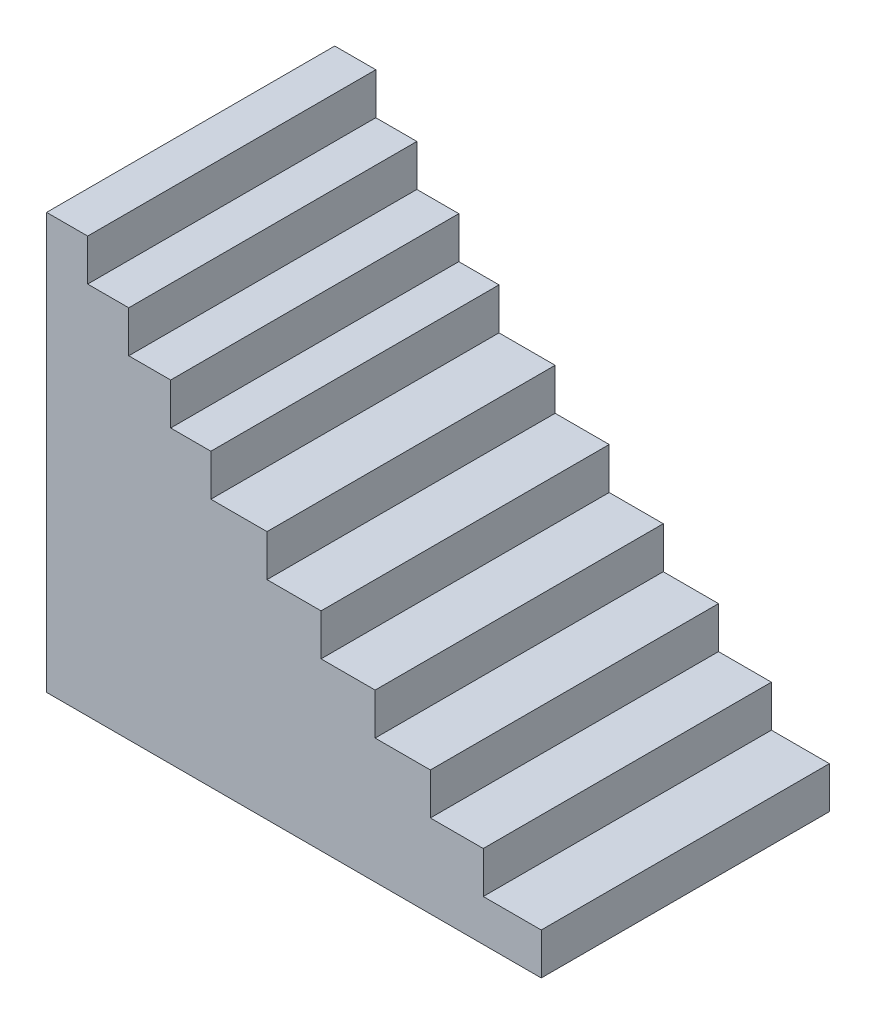
ISO-10303-21;
HEADER;
FILE_DESCRIPTION(('STEP AP214'),'2;1');
FILE_NAME('part.step','',(''),(''),'','','');
FILE_SCHEMA(('AUTOMOTIVE_DESIGN { 1 0 10303 214 1 1 1 1 }'));
ENDSEC;
DATA;
#1=APPLICATION_CONTEXT('core data for automotive mechanical design processes');
#2=APPLICATION_PROTOCOL_DEFINITION('international standard','automotive_design',2000,#1);
#3=PRODUCT_CONTEXT('',#1,'mechanical');
#4=PRODUCT('Part','Part','',(#3));
#5=PRODUCT_RELATED_PRODUCT_CATEGORY('part','',(#4));
#6=PRODUCT_DEFINITION_FORMATION('','',#4);
#7=PRODUCT_DEFINITION_CONTEXT('part definition',#1,'design');
#8=PRODUCT_DEFINITION('design','',#6,#7);
#9=PRODUCT_DEFINITION_SHAPE('','',#8);
#10=(LENGTH_UNIT() NAMED_UNIT(*) SI_UNIT(.MILLI.,.METRE.));
#11=(NAMED_UNIT(*) PLANE_ANGLE_UNIT() SI_UNIT($,.RADIAN.));
#12=(NAMED_UNIT(*) SI_UNIT($,.STERADIAN.) SOLID_ANGLE_UNIT());
#13=UNCERTAINTY_MEASURE_WITH_UNIT(LENGTH_MEASURE(1.E-05),#10,'distance_accuracy_value','');
#14=(GEOMETRIC_REPRESENTATION_CONTEXT(3) GLOBAL_UNCERTAINTY_ASSIGNED_CONTEXT((#13)) GLOBAL_UNIT_ASSIGNED_CONTEXT((#10,
#11,#12)) REPRESENTATION_CONTEXT('',''));
#15=CARTESIAN_POINT('',(0.,0.,0.));
#16=DIRECTION('',(0.,0.,1.));
#17=DIRECTION('',(1.,0.,0.));
#18=AXIS2_PLACEMENT_3D('',#15,#16,#17);
#19=CARTESIAN_POINT('',(0.,0.,901.));
#20=DIRECTION('',(-1.,0.,0.));
#21=DIRECTION('',(0.,0.,1.));
#22=AXIS2_PLACEMENT_3D('',#19,#20,#21);
#23=PLANE('',#22);
#24=DIRECTION('',(0.,1.,0.));
#25=VECTOR('',#24,1.);
#26=CARTESIAN_POINT('',(0.,0.,0.));
#27=LINE('',#26,#25);
#28=CARTESIAN_POINT('',(0.,-260.,0.));
#29=VERTEX_POINT('',#28);
#30=CARTESIAN_POINT('',(0.,1040.,0.));
#31=VERTEX_POINT('',#30);
#32=EDGE_CURVE('E215',#29,#31,#27,.T.);
#33=ORIENTED_EDGE('',*,*,#32,.F.);
#34=DIRECTION('',(0.,0.,-1.));
#35=VECTOR('',#34,1.);
#36=CARTESIAN_POINT('',(0.,-260.,901.));
#37=LINE('',#36,#35);
#38=CARTESIAN_POINT('',(0.,-260.,901.));
#39=VERTEX_POINT('',#38);
#40=EDGE_CURVE('E11',#39,#29,#37,.T.);
#41=ORIENTED_EDGE('',*,*,#40,.F.);
#42=DIRECTION('',(0.,1.,0.));
#43=VECTOR('',#42,1.);
#44=CARTESIAN_POINT('',(0.,0.,901.));
#45=LINE('',#44,#43);
#46=CARTESIAN_POINT('',(0.,1040.,901.));
#47=VERTEX_POINT('',#46);
#48=EDGE_CURVE('E277',#39,#47,#45,.T.);
#49=ORIENTED_EDGE('',*,*,#48,.T.);
#50=DIRECTION('',(0.,0.,-1.));
#51=VECTOR('',#50,1.);
#52=CARTESIAN_POINT('',(0.,1040.,901.));
#53=LINE('',#52,#51);
#54=EDGE_CURVE('E51',#47,#31,#53,.T.);
#55=ORIENTED_EDGE('',*,*,#54,.T.);
#56=EDGE_LOOP('',(#33,#41,#49,#55));
#57=FACE_BOUND('',#56,.T.);
#58=ADVANCED_FACE('F35',(#57),#23,.T.);
#59=CARTESIAN_POINT('',(0.,-260.,901.));
#60=DIRECTION('',(0.,1.,0.));
#61=DIRECTION('',(0.,0.,1.));
#62=AXIS2_PLACEMENT_3D('',#59,#60,#61);
#63=PLANE('',#62);
#64=DIRECTION('',(1.,0.,0.));
#65=VECTOR('',#64,1.);
#66=CARTESIAN_POINT('',(0.,-260.,0.));
#67=LINE('',#66,#65);
#68=CARTESIAN_POINT('',(1546.73830223801,-260.,0.));
#69=VERTEX_POINT('',#68);
#70=EDGE_CURVE('E217',#29,#69,#67,.T.);
#71=ORIENTED_EDGE('',*,*,#70,.T.);
#72=DIRECTION('',(0.,0.,-1.));
#73=VECTOR('',#72,1.);
#74=CARTESIAN_POINT('',(1546.73830223801,-260.,901.));
#75=LINE('',#74,#73);
#76=CARTESIAN_POINT('',(1546.73830223801,-260.,901.));
#77=VERTEX_POINT('',#76);
#78=EDGE_CURVE('E43',#77,#69,#75,.T.);
#79=ORIENTED_EDGE('',*,*,#78,.F.);
#80=DIRECTION('',(1.,0.,0.));
#81=VECTOR('',#80,1.);
#82=CARTESIAN_POINT('',(0.,-260.,901.));
#83=LINE('',#82,#81);
#84=EDGE_CURVE('E333',#39,#77,#83,.T.);
#85=ORIENTED_EDGE('',*,*,#84,.F.);
#86=ORIENTED_EDGE('',*,*,#40,.T.);
#87=EDGE_LOOP('',(#71,#79,#85,#86));
#88=FACE_BOUND('',#87,.T.);
#89=ADVANCED_FACE('F321',(#88),#63,.F.);
#90=CARTESIAN_POINT('',(1546.73830223801,0.,901.));
#91=DIRECTION('',(1.,0.,0.));
#92=DIRECTION('',(0.,0.,-1.));
#93=AXIS2_PLACEMENT_3D('',#90,#91,#92);
#94=PLANE('',#93);
#95=DIRECTION('',(0.,-1.,0.));
#96=VECTOR('',#95,1.);
#97=CARTESIAN_POINT('',(1546.73830223801,0.,0.));
#98=LINE('',#97,#96);
#99=CARTESIAN_POINT('',(1546.73830223801,-130.,0.));
#100=VERTEX_POINT('',#99);
#101=EDGE_CURVE('E220',#100,#69,#98,.T.);
#102=ORIENTED_EDGE('',*,*,#101,.F.);
#103=DIRECTION('',(0.,0.,-1.));
#104=VECTOR('',#103,1.);
#105=CARTESIAN_POINT('',(1546.73830223801,-130.,901.));
#106=LINE('',#105,#104);
#107=CARTESIAN_POINT('',(1546.73830223801,-130.,901.));
#108=VERTEX_POINT('',#107);
#109=EDGE_CURVE('E311',#108,#100,#106,.T.);
#110=ORIENTED_EDGE('',*,*,#109,.F.);
#111=DIRECTION('',(0.,-1.,0.));
#112=VECTOR('',#111,1.);
#113=CARTESIAN_POINT('',(1546.73830223801,0.,901.));
#114=LINE('',#113,#112);
#115=EDGE_CURVE('E318',#108,#77,#114,.T.);
#116=ORIENTED_EDGE('',*,*,#115,.T.);
#117=ORIENTED_EDGE('',*,*,#78,.T.);
#118=EDGE_LOOP('',(#102,#110,#116,#117));
#119=FACE_BOUND('',#118,.T.);
#120=ADVANCED_FACE('F316',(#119),#94,.T.);
#121=CARTESIAN_POINT('',(0.,-130.,901.));
#122=DIRECTION('',(0.,1.,0.));
#123=DIRECTION('',(0.,0.,1.));
#124=AXIS2_PLACEMENT_3D('',#121,#122,#123);
#125=PLANE('',#124);
#126=DIRECTION('',(1.,0.,0.));
#127=VECTOR('',#126,1.);
#128=CARTESIAN_POINT('',(0.,-130.,0.));
#129=LINE('',#128,#127);
#130=CARTESIAN_POINT('',(1365.38737837374,-130.,0.));
#131=VERTEX_POINT('',#130);
#132=EDGE_CURVE('E223',#131,#100,#129,.T.);
#133=ORIENTED_EDGE('',*,*,#132,.F.);
#134=DIRECTION('',(0.,0.,-1.));
#135=VECTOR('',#134,1.);
#136=CARTESIAN_POINT('',(1365.38737837374,-130.,901.));
#137=LINE('',#136,#135);
#138=CARTESIAN_POINT('',(1365.38737837374,-130.,901.));
#139=VERTEX_POINT('',#138);
#140=EDGE_CURVE('E309',#139,#131,#137,.T.);
#141=ORIENTED_EDGE('',*,*,#140,.F.);
#142=DIRECTION('',(1.,0.,0.));
#143=VECTOR('',#142,1.);
#144=CARTESIAN_POINT('',(0.,-130.,901.));
#145=LINE('',#144,#143);
#146=EDGE_CURVE('E330',#139,#108,#145,.T.);
#147=ORIENTED_EDGE('',*,*,#146,.T.);
#148=ORIENTED_EDGE('',*,*,#109,.T.);
#149=EDGE_LOOP('',(#133,#141,#147,#148));
#150=FACE_BOUND('',#149,.T.);
#151=ADVANCED_FACE('F327',(#150),#125,.T.);
#152=CARTESIAN_POINT('',(1365.38737837374,0.,901.));
#153=DIRECTION('',(1.,0.,0.));
#154=DIRECTION('',(0.,0.,-1.));
#155=AXIS2_PLACEMENT_3D('',#152,#153,#154);
#156=PLANE('',#155);
#157=DIRECTION('',(0.,-1.,0.));
#158=VECTOR('',#157,1.);
#159=CARTESIAN_POINT('',(1365.38737837374,0.,0.));
#160=LINE('',#159,#158);
#161=CARTESIAN_POINT('',(1365.38737837374,0.,0.));
#162=VERTEX_POINT('',#161);
#163=EDGE_CURVE('E226',#162,#131,#160,.T.);
#164=ORIENTED_EDGE('',*,*,#163,.F.);
#165=DIRECTION('',(0.,0.,-1.));
#166=VECTOR('',#165,1.);
#167=CARTESIAN_POINT('',(1365.38737837374,0.,901.));
#168=LINE('',#167,#166);
#169=CARTESIAN_POINT('',(1365.38737837374,0.,901.));
#170=VERTEX_POINT('',#169);
#171=EDGE_CURVE('E307',#170,#162,#168,.T.);
#172=ORIENTED_EDGE('',*,*,#171,.F.);
#173=DIRECTION('',(0.,-1.,0.));
#174=VECTOR('',#173,1.);
#175=CARTESIAN_POINT('',(1365.38737837374,0.,901.));
#176=LINE('',#175,#174);
#177=EDGE_CURVE('E335',#170,#139,#176,.T.);
#178=ORIENTED_EDGE('',*,*,#177,.T.);
#179=ORIENTED_EDGE('',*,*,#140,.T.);
#180=EDGE_LOOP('',(#164,#172,#178,#179));
#181=FACE_BOUND('',#180,.T.);
#182=ADVANCED_FACE('F567',(#181),#156,.T.);
#183=CARTESIAN_POINT('',(0.,0.,901.));
#184=DIRECTION('',(0.,1.,0.));
#185=DIRECTION('',(0.,0.,1.));
#186=AXIS2_PLACEMENT_3D('',#183,#184,#185);
#187=PLANE('',#186);
#188=DIRECTION('',(1.,0.,0.));
#189=VECTOR('',#188,1.);
#190=CARTESIAN_POINT('',(0.,0.,0.));
#191=LINE('',#190,#189);
#192=CARTESIAN_POINT('',(1200.,0.,0.));
#193=VERTEX_POINT('',#192);
#194=EDGE_CURVE('E229',#193,#162,#191,.T.);
#195=ORIENTED_EDGE('',*,*,#194,.F.);
#196=DIRECTION('',(0.,0.,-1.));
#197=VECTOR('',#196,1.);
#198=CARTESIAN_POINT('',(1200.,0.,901.));
#199=LINE('',#198,#197);
#200=CARTESIAN_POINT('',(1200.,0.,901.));
#201=VERTEX_POINT('',#200);
#202=EDGE_CURVE('E305',#201,#193,#199,.T.);
#203=ORIENTED_EDGE('',*,*,#202,.F.);
#204=DIRECTION('',(1.,0.,0.));
#205=VECTOR('',#204,1.);
#206=CARTESIAN_POINT('',(0.,0.,901.));
#207=LINE('',#206,#205);
#208=EDGE_CURVE('E341',#201,#170,#207,.T.);
#209=ORIENTED_EDGE('',*,*,#208,.T.);
#210=ORIENTED_EDGE('',*,*,#171,.T.);
#211=EDGE_LOOP('',(#195,#203,#209,#210));
#212=FACE_BOUND('',#211,.T.);
#213=ADVANCED_FACE('F557',(#212),#187,.T.);
#214=CARTESIAN_POINT('',(1200.,0.,901.));
#215=DIRECTION('',(-1.,0.,0.));
#216=DIRECTION('',(0.,0.,1.));
#217=AXIS2_PLACEMENT_3D('',#214,#215,#216);
#218=PLANE('',#217);
#219=DIRECTION('',(0.,1.,0.));
#220=VECTOR('',#219,1.);
#221=CARTESIAN_POINT('',(1200.,0.,0.));
#222=LINE('',#221,#220);
#223=CARTESIAN_POINT('',(1200.,130.,0.));
#224=VERTEX_POINT('',#223);
#225=EDGE_CURVE('E232',#193,#224,#222,.T.);
#226=ORIENTED_EDGE('',*,*,#225,.T.);
#227=DIRECTION('',(0.,0.,-1.));
#228=VECTOR('',#227,1.);
#229=CARTESIAN_POINT('',(1200.,130.,901.));
#230=LINE('',#229,#228);
#231=CARTESIAN_POINT('',(1200.,130.,901.));
#232=VERTEX_POINT('',#231);
#233=EDGE_CURVE('E303',#232,#224,#230,.T.);
#234=ORIENTED_EDGE('',*,*,#233,.F.);
#235=DIRECTION('',(0.,1.,0.));
#236=VECTOR('',#235,1.);
#237=CARTESIAN_POINT('',(1200.,0.,901.));
#238=LINE('',#237,#236);
#239=EDGE_CURVE('E344',#201,#232,#238,.T.);
#240=ORIENTED_EDGE('',*,*,#239,.F.);
#241=ORIENTED_EDGE('',*,*,#202,.T.);
#242=EDGE_LOOP('',(#226,#234,#240,#241));
#243=FACE_BOUND('',#242,.T.);
#244=ADVANCED_FACE('F546',(#243),#218,.F.);
#245=CARTESIAN_POINT('',(0.,130.,901.));
#246=DIRECTION('',(0.,1.,0.));
#247=DIRECTION('',(0.,0.,1.));
#248=AXIS2_PLACEMENT_3D('',#245,#246,#247);
#249=PLANE('',#248);
#250=DIRECTION('',(1.,0.,0.));
#251=VECTOR('',#250,1.);
#252=CARTESIAN_POINT('',(0.,130.,0.));
#253=LINE('',#252,#251);
#254=CARTESIAN_POINT('',(1027.27548642339,130.,0.));
#255=VERTEX_POINT('',#254);
#256=EDGE_CURVE('E235',#255,#224,#253,.T.);
#257=ORIENTED_EDGE('',*,*,#256,.F.);
#258=DIRECTION('',(0.,0.,-1.));
#259=VECTOR('',#258,1.);
#260=CARTESIAN_POINT('',(1027.27548642339,130.,901.));
#261=LINE('',#260,#259);
#262=CARTESIAN_POINT('',(1027.27548642339,130.,901.));
#263=VERTEX_POINT('',#262);
#264=EDGE_CURVE('E301',#263,#255,#261,.T.);
#265=ORIENTED_EDGE('',*,*,#264,.F.);
#266=DIRECTION('',(1.,0.,0.));
#267=VECTOR('',#266,1.);
#268=CARTESIAN_POINT('',(0.,130.,901.));
#269=LINE('',#268,#267);
#270=EDGE_CURVE('E346',#263,#232,#269,.T.);
#271=ORIENTED_EDGE('',*,*,#270,.T.);
#272=ORIENTED_EDGE('',*,*,#233,.T.);
#273=EDGE_LOOP('',(#257,#265,#271,#272));
#274=FACE_BOUND('',#273,.T.);
#275=ADVANCED_FACE('F536',(#274),#249,.T.);
#276=CARTESIAN_POINT('',(1027.27548642339,0.,901.));
#277=DIRECTION('',(-1.,0.,0.));
#278=DIRECTION('',(0.,0.,1.));
#279=AXIS2_PLACEMENT_3D('',#276,#277,#278);
#280=PLANE('',#279);
#281=DIRECTION('',(0.,1.,0.));
#282=VECTOR('',#281,1.);
#283=CARTESIAN_POINT('',(1027.27548642339,0.,0.));
#284=LINE('',#283,#282);
#285=CARTESIAN_POINT('',(1027.27548642339,260.,0.));
#286=VERTEX_POINT('',#285);
#287=EDGE_CURVE('E238',#255,#286,#284,.T.);
#288=ORIENTED_EDGE('',*,*,#287,.T.);
#289=DIRECTION('',(0.,0.,-1.));
#290=VECTOR('',#289,1.);
#291=CARTESIAN_POINT('',(1027.27548642339,260.,901.));
#292=LINE('',#291,#290);
#293=CARTESIAN_POINT('',(1027.27548642339,260.,901.));
#294=VERTEX_POINT('',#293);
#295=EDGE_CURVE('E299',#294,#286,#292,.T.);
#296=ORIENTED_EDGE('',*,*,#295,.F.);
#297=DIRECTION('',(0.,1.,0.));
#298=VECTOR('',#297,1.);
#299=CARTESIAN_POINT('',(1027.27548642339,0.,901.));
#300=LINE('',#299,#298);
#301=EDGE_CURVE('E349',#263,#294,#300,.T.);
#302=ORIENTED_EDGE('',*,*,#301,.F.);
#303=ORIENTED_EDGE('',*,*,#264,.T.);
#304=EDGE_LOOP('',(#288,#296,#302,#303));
#305=FACE_BOUND('',#304,.T.);
#306=ADVANCED_FACE('F525',(#305),#280,.F.);
#307=CARTESIAN_POINT('',(0.,260.,901.));
#308=DIRECTION('',(0.,1.,0.));
#309=DIRECTION('',(0.,0.,1.));
#310=AXIS2_PLACEMENT_3D('',#307,#308,#309);
#311=PLANE('',#310);
#312=DIRECTION('',(1.,0.,0.));
#313=VECTOR('',#312,1.);
#314=CARTESIAN_POINT('',(0.,260.,0.));
#315=LINE('',#314,#313);
#316=CARTESIAN_POINT('',(858.21954044822,260.,0.));
#317=VERTEX_POINT('',#316);
#318=EDGE_CURVE('E241',#317,#286,#315,.T.);
#319=ORIENTED_EDGE('',*,*,#318,.F.);
#320=DIRECTION('',(0.,0.,-1.));
#321=VECTOR('',#320,1.);
#322=CARTESIAN_POINT('',(858.21954044822,260.,901.));
#323=LINE('',#322,#321);
#324=CARTESIAN_POINT('',(858.21954044822,260.,901.));
#325=VERTEX_POINT('',#324);
#326=EDGE_CURVE('E297',#325,#317,#323,.T.);
#327=ORIENTED_EDGE('',*,*,#326,.F.);
#328=DIRECTION('',(1.,0.,0.));
#329=VECTOR('',#328,1.);
#330=CARTESIAN_POINT('',(0.,260.,901.));
#331=LINE('',#330,#329);
#332=EDGE_CURVE('E351',#325,#294,#331,.T.);
#333=ORIENTED_EDGE('',*,*,#332,.T.);
#334=ORIENTED_EDGE('',*,*,#295,.T.);
#335=EDGE_LOOP('',(#319,#327,#333,#334));
#336=FACE_BOUND('',#335,.T.);
#337=ADVANCED_FACE('F515',(#336),#311,.T.);
#338=CARTESIAN_POINT('',(858.21954044822,0.,901.));
#339=DIRECTION('',(-1.,0.,0.));
#340=DIRECTION('',(0.,0.,1.));
#341=AXIS2_PLACEMENT_3D('',#338,#339,#340);
#342=PLANE('',#341);
#343=DIRECTION('',(0.,1.,0.));
#344=VECTOR('',#343,1.);
#345=CARTESIAN_POINT('',(858.21954044822,0.,0.));
#346=LINE('',#345,#344);
#347=CARTESIAN_POINT('',(858.21954044822,390.,0.));
#348=VERTEX_POINT('',#347);
#349=EDGE_CURVE('E244',#317,#348,#346,.T.);
#350=ORIENTED_EDGE('',*,*,#349,.T.);
#351=DIRECTION('',(0.,0.,-1.));
#352=VECTOR('',#351,1.);
#353=CARTESIAN_POINT('',(858.21954044822,390.,901.));
#354=LINE('',#353,#352);
#355=CARTESIAN_POINT('',(858.21954044822,390.,901.));
#356=VERTEX_POINT('',#355);
#357=EDGE_CURVE('E295',#356,#348,#354,.T.);
#358=ORIENTED_EDGE('',*,*,#357,.F.);
#359=DIRECTION('',(0.,1.,0.));
#360=VECTOR('',#359,1.);
#361=CARTESIAN_POINT('',(858.21954044822,0.,901.));
#362=LINE('',#361,#360);
#363=EDGE_CURVE('E354',#325,#356,#362,.T.);
#364=ORIENTED_EDGE('',*,*,#363,.F.);
#365=ORIENTED_EDGE('',*,*,#326,.T.);
#366=EDGE_LOOP('',(#350,#358,#364,#365));
#367=FACE_BOUND('',#366,.T.);
#368=ADVANCED_FACE('F504',(#367),#342,.F.);
#369=CARTESIAN_POINT('',(0.,390.,901.));
#370=DIRECTION('',(0.,1.,0.));
#371=DIRECTION('',(0.,0.,1.));
#372=AXIS2_PLACEMENT_3D('',#369,#370,#371);
#373=PLANE('',#372);
#374=DIRECTION('',(1.,0.,0.));
#375=VECTOR('',#374,1.);
#376=CARTESIAN_POINT('',(0.,390.,0.));
#377=LINE('',#376,#375);
#378=CARTESIAN_POINT('',(689.163594473048,390.,0.));
#379=VERTEX_POINT('',#378);
#380=EDGE_CURVE('E247',#379,#348,#377,.T.);
#381=ORIENTED_EDGE('',*,*,#380,.F.);
#382=DIRECTION('',(0.,0.,-1.));
#383=VECTOR('',#382,1.);
#384=CARTESIAN_POINT('',(689.163594473048,390.,901.));
#385=LINE('',#384,#383);
#386=CARTESIAN_POINT('',(689.163594473048,390.,901.));
#387=VERTEX_POINT('',#386);
#388=EDGE_CURVE('E293',#387,#379,#385,.T.);
#389=ORIENTED_EDGE('',*,*,#388,.F.);
#390=DIRECTION('',(1.,0.,0.));
#391=VECTOR('',#390,1.);
#392=CARTESIAN_POINT('',(0.,390.,901.));
#393=LINE('',#392,#391);
#394=EDGE_CURVE('E356',#387,#356,#393,.T.);
#395=ORIENTED_EDGE('',*,*,#394,.T.);
#396=ORIENTED_EDGE('',*,*,#357,.T.);
#397=EDGE_LOOP('',(#381,#389,#395,#396));
#398=FACE_BOUND('',#397,.T.);
#399=ADVANCED_FACE('F494',(#398),#373,.T.);
#400=CARTESIAN_POINT('',(689.163594473048,0.,901.));
#401=DIRECTION('',(-1.,0.,0.));
#402=DIRECTION('',(0.,0.,1.));
#403=AXIS2_PLACEMENT_3D('',#400,#401,#402);
#404=PLANE('',#403);
#405=DIRECTION('',(0.,1.,0.));
#406=VECTOR('',#405,1.);
#407=CARTESIAN_POINT('',(689.163594473048,0.,0.));
#408=LINE('',#407,#406);
#409=CARTESIAN_POINT('',(689.163594473048,520.,0.));
#410=VERTEX_POINT('',#409);
#411=EDGE_CURVE('E250',#379,#410,#408,.T.);
#412=ORIENTED_EDGE('',*,*,#411,.T.);
#413=DIRECTION('',(0.,0.,-1.));
#414=VECTOR('',#413,1.);
#415=CARTESIAN_POINT('',(689.163594473048,520.,901.));
#416=LINE('',#415,#414);
#417=CARTESIAN_POINT('',(689.163594473048,520.,901.));
#418=VERTEX_POINT('',#417);
#419=EDGE_CURVE('E291',#418,#410,#416,.T.);
#420=ORIENTED_EDGE('',*,*,#419,.F.);
#421=DIRECTION('',(0.,1.,0.));
#422=VECTOR('',#421,1.);
#423=CARTESIAN_POINT('',(689.163594473048,0.,901.));
#424=LINE('',#423,#422);
#425=EDGE_CURVE('E359',#387,#418,#424,.T.);
#426=ORIENTED_EDGE('',*,*,#425,.F.);
#427=ORIENTED_EDGE('',*,*,#388,.T.);
#428=EDGE_LOOP('',(#412,#420,#426,#427));
#429=FACE_BOUND('',#428,.T.);
#430=ADVANCED_FACE('F483',(#429),#404,.F.);
#431=CARTESIAN_POINT('',(0.,520.,901.));
#432=DIRECTION('',(0.,1.,0.));
#433=DIRECTION('',(0.,0.,1.));
#434=AXIS2_PLACEMENT_3D('',#431,#432,#433);
#435=PLANE('',#434);
#436=DIRECTION('',(1.,0.,0.));
#437=VECTOR('',#436,1.);
#438=CARTESIAN_POINT('',(0.,520.,0.));
#439=LINE('',#438,#437);
#440=CARTESIAN_POINT('',(513.637743211696,520.,0.));
#441=VERTEX_POINT('',#440);
#442=EDGE_CURVE('E253',#441,#410,#439,.T.);
#443=ORIENTED_EDGE('',*,*,#442,.F.);
#444=DIRECTION('',(0.,0.,-1.));
#445=VECTOR('',#444,1.);
#446=CARTESIAN_POINT('',(513.637743211696,520.,901.));
#447=LINE('',#446,#445);
#448=CARTESIAN_POINT('',(513.637743211696,520.,901.));
#449=VERTEX_POINT('',#448);
#450=EDGE_CURVE('E289',#449,#441,#447,.T.);
#451=ORIENTED_EDGE('',*,*,#450,.F.);
#452=DIRECTION('',(1.,0.,0.));
#453=VECTOR('',#452,1.);
#454=CARTESIAN_POINT('',(0.,520.,901.));
#455=LINE('',#454,#453);
#456=EDGE_CURVE('E361',#449,#418,#455,.T.);
#457=ORIENTED_EDGE('',*,*,#456,.T.);
#458=ORIENTED_EDGE('',*,*,#419,.T.);
#459=EDGE_LOOP('',(#443,#451,#457,#458));
#460=FACE_BOUND('',#459,.T.);
#461=ADVANCED_FACE('F473',(#460),#435,.T.);
#462=CARTESIAN_POINT('',(513.637743211696,0.,901.));
#463=DIRECTION('',(-1.,0.,0.));
#464=DIRECTION('',(0.,0.,1.));
#465=AXIS2_PLACEMENT_3D('',#462,#463,#464);
#466=PLANE('',#465);
#467=DIRECTION('',(0.,1.,0.));
#468=VECTOR('',#467,1.);
#469=CARTESIAN_POINT('',(513.637743211696,0.,0.));
#470=LINE('',#469,#468);
#471=CARTESIAN_POINT('',(513.637743211696,650.,0.));
#472=VERTEX_POINT('',#471);
#473=EDGE_CURVE('E256',#441,#472,#470,.T.);
#474=ORIENTED_EDGE('',*,*,#473,.T.);
#475=DIRECTION('',(0.,0.,-1.));
#476=VECTOR('',#475,1.);
#477=CARTESIAN_POINT('',(513.637743211696,650.,901.));
#478=LINE('',#477,#476);
#479=CARTESIAN_POINT('',(513.637743211696,650.,901.));
#480=VERTEX_POINT('',#479);
#481=EDGE_CURVE('E287',#480,#472,#478,.T.);
#482=ORIENTED_EDGE('',*,*,#481,.F.);
#483=DIRECTION('',(0.,1.,0.));
#484=VECTOR('',#483,1.);
#485=CARTESIAN_POINT('',(513.637743211696,0.,901.));
#486=LINE('',#485,#484);
#487=EDGE_CURVE('E364',#449,#480,#486,.T.);
#488=ORIENTED_EDGE('',*,*,#487,.F.);
#489=ORIENTED_EDGE('',*,*,#450,.T.);
#490=EDGE_LOOP('',(#474,#482,#488,#489));
#491=FACE_BOUND('',#490,.T.);
#492=ADVANCED_FACE('F462',(#491),#466,.F.);
#493=CARTESIAN_POINT('',(0.,650.,901.));
#494=DIRECTION('',(0.,1.,0.));
#495=DIRECTION('',(0.,0.,1.));
#496=AXIS2_PLACEMENT_3D('',#493,#494,#495);
#497=PLANE('',#496);
#498=DIRECTION('',(1.,0.,0.));
#499=VECTOR('',#498,1.);
#500=CARTESIAN_POINT('',(0.,650.,0.));
#501=LINE('',#500,#499);
#502=CARTESIAN_POINT('',(387.936636190014,650.,0.));
#503=VERTEX_POINT('',#502);
#504=EDGE_CURVE('E259',#503,#472,#501,.T.);
#505=ORIENTED_EDGE('',*,*,#504,.F.);
#506=DIRECTION('',(0.,0.,-1.));
#507=VECTOR('',#506,1.);
#508=CARTESIAN_POINT('',(387.936636190014,650.,901.));
#509=LINE('',#508,#507);
#510=CARTESIAN_POINT('',(387.936636190014,650.,901.));
#511=VERTEX_POINT('',#510);
#512=EDGE_CURVE('E285',#511,#503,#509,.T.);
#513=ORIENTED_EDGE('',*,*,#512,.F.);
#514=DIRECTION('',(1.,0.,0.));
#515=VECTOR('',#514,1.);
#516=CARTESIAN_POINT('',(0.,650.,901.));
#517=LINE('',#516,#515);
#518=EDGE_CURVE('E366',#511,#480,#517,.T.);
#519=ORIENTED_EDGE('',*,*,#518,.T.);
#520=ORIENTED_EDGE('',*,*,#481,.T.);
#521=EDGE_LOOP('',(#505,#513,#519,#520));
#522=FACE_BOUND('',#521,.T.);
#523=ADVANCED_FACE('F453',(#522),#497,.T.);
#524=CARTESIAN_POINT('',(387.936636190014,0.,901.));
#525=DIRECTION('',(-1.,0.,0.));
#526=DIRECTION('',(0.,0.,1.));
#527=AXIS2_PLACEMENT_3D('',#524,#525,#526);
#528=PLANE('',#527);
#529=DIRECTION('',(0.,1.,0.));
#530=VECTOR('',#529,1.);
#531=CARTESIAN_POINT('',(387.936636190014,0.,0.));
#532=LINE('',#531,#530);
#533=CARTESIAN_POINT('',(387.936636190014,780.,0.));
#534=VERTEX_POINT('',#533);
#535=EDGE_CURVE('E262',#503,#534,#532,.T.);
#536=ORIENTED_EDGE('',*,*,#535,.T.);
#537=DIRECTION('',(0.,0.,-1.));
#538=VECTOR('',#537,1.);
#539=CARTESIAN_POINT('',(387.936636190014,780.,901.));
#540=LINE('',#539,#538);
#541=CARTESIAN_POINT('',(387.936636190014,780.,901.));
#542=VERTEX_POINT('',#541);
#543=EDGE_CURVE('E283',#542,#534,#540,.T.);
#544=ORIENTED_EDGE('',*,*,#543,.F.);
#545=DIRECTION('',(0.,1.,0.));
#546=VECTOR('',#545,1.);
#547=CARTESIAN_POINT('',(387.936636190014,0.,901.));
#548=LINE('',#547,#546);
#549=EDGE_CURVE('E369',#511,#542,#548,.T.);
#550=ORIENTED_EDGE('',*,*,#549,.F.);
#551=ORIENTED_EDGE('',*,*,#512,.T.);
#552=EDGE_LOOP('',(#536,#544,#550,#551));
#553=FACE_BOUND('',#552,.T.);
#554=ADVANCED_FACE('F378',(#553),#528,.F.);
#555=CARTESIAN_POINT('',(0.,780.,901.));
#556=DIRECTION('',(0.,1.,0.));
#557=DIRECTION('',(0.,0.,1.));
#558=AXIS2_PLACEMENT_3D('',#555,#556,#557);
#559=PLANE('',#558);
#560=DIRECTION('',(1.,0.,0.));
#561=VECTOR('',#560,1.);
#562=CARTESIAN_POINT('',(0.,780.,0.));
#563=LINE('',#562,#561);
#564=CARTESIAN_POINT('',(256.818871605848,780.,0.));
#565=VERTEX_POINT('',#564);
#566=EDGE_CURVE('E265',#565,#534,#563,.T.);
#567=ORIENTED_EDGE('',*,*,#566,.F.);
#568=DIRECTION('',(0.,0.,-1.));
#569=VECTOR('',#568,1.);
#570=CARTESIAN_POINT('',(256.818871605848,780.,901.));
#571=LINE('',#570,#569);
#572=CARTESIAN_POINT('',(256.818871605848,780.,901.));
#573=VERTEX_POINT('',#572);
#574=EDGE_CURVE('E281',#573,#565,#571,.T.);
#575=ORIENTED_EDGE('',*,*,#574,.F.);
#576=DIRECTION('',(1.,0.,0.));
#577=VECTOR('',#576,1.);
#578=CARTESIAN_POINT('',(0.,780.,901.));
#579=LINE('',#578,#577);
#580=EDGE_CURVE('E210',#573,#542,#579,.T.);
#581=ORIENTED_EDGE('',*,*,#580,.T.);
#582=ORIENTED_EDGE('',*,*,#543,.T.);
#583=EDGE_LOOP('',(#567,#575,#581,#582));
#584=FACE_BOUND('',#583,.T.);
#585=ADVANCED_FACE('F373',(#584),#559,.T.);
#586=CARTESIAN_POINT('',(256.818871605848,0.,901.));
#587=DIRECTION('',(-1.,0.,0.));
#588=DIRECTION('',(0.,0.,1.));
#589=AXIS2_PLACEMENT_3D('',#586,#587,#588);
#590=PLANE('',#589);
#591=DIRECTION('',(0.,1.,0.));
#592=VECTOR('',#591,1.);
#593=CARTESIAN_POINT('',(256.818871605848,0.,0.));
#594=LINE('',#593,#592);
#595=CARTESIAN_POINT('',(256.818871605848,910.,0.));
#596=VERTEX_POINT('',#595);
#597=EDGE_CURVE('E268',#565,#596,#594,.T.);
#598=ORIENTED_EDGE('',*,*,#597,.T.);
#599=DIRECTION('',(0.,0.,-1.));
#600=VECTOR('',#599,1.);
#601=CARTESIAN_POINT('',(256.818871605848,910.,901.));
#602=LINE('',#601,#600);
#603=CARTESIAN_POINT('',(256.818871605848,910.,901.));
#604=VERTEX_POINT('',#603);
#605=EDGE_CURVE('E195',#604,#596,#602,.T.);
#606=ORIENTED_EDGE('',*,*,#605,.F.);
#607=DIRECTION('',(0.,1.,0.));
#608=VECTOR('',#607,1.);
#609=CARTESIAN_POINT('',(256.818871605848,0.,901.));
#610=LINE('',#609,#608);
#611=EDGE_CURVE('E207',#573,#604,#610,.T.);
#612=ORIENTED_EDGE('',*,*,#611,.F.);
#613=ORIENTED_EDGE('',*,*,#574,.T.);
#614=EDGE_LOOP('',(#598,#606,#612,#613));
#615=FACE_BOUND('',#614,.T.);
#616=ADVANCED_FACE('F383',(#615),#590,.F.);
#617=CARTESIAN_POINT('',(0.,910.,901.));
#618=DIRECTION('',(0.,1.,0.));
#619=DIRECTION('',(0.,0.,1.));
#620=AXIS2_PLACEMENT_3D('',#617,#618,#619);
#621=PLANE('',#620);
#622=DIRECTION('',(1.,0.,0.));
#623=VECTOR('',#622,1.);
#624=CARTESIAN_POINT('',(0.,910.,0.));
#625=LINE('',#624,#623);
#626=CARTESIAN_POINT('',(128.409435802924,910.,0.));
#627=VERTEX_POINT('',#626);
#628=EDGE_CURVE('E192',#627,#596,#625,.T.);
#629=ORIENTED_EDGE('',*,*,#628,.F.);
#630=DIRECTION('',(0.,0.,-1.));
#631=VECTOR('',#630,1.);
#632=CARTESIAN_POINT('',(128.409435802924,910.,901.));
#633=LINE('',#632,#631);
#634=CARTESIAN_POINT('',(128.409435802924,910.,901.));
#635=VERTEX_POINT('',#634);
#636=EDGE_CURVE('E186',#635,#627,#633,.T.);
#637=ORIENTED_EDGE('',*,*,#636,.F.);
#638=DIRECTION('',(1.,0.,0.));
#639=VECTOR('',#638,1.);
#640=CARTESIAN_POINT('',(0.,910.,901.));
#641=LINE('',#640,#639);
#642=EDGE_CURVE('E190',#635,#604,#641,.T.);
#643=ORIENTED_EDGE('',*,*,#642,.T.);
#644=ORIENTED_EDGE('',*,*,#605,.T.);
#645=EDGE_LOOP('',(#629,#637,#643,#644));
#646=FACE_BOUND('',#645,.T.);
#647=ADVANCED_FACE('F188',(#646),#621,.T.);
#648=CARTESIAN_POINT('',(128.409435802924,0.,901.));
#649=DIRECTION('',(-1.,0.,0.));
#650=DIRECTION('',(0.,0.,1.));
#651=AXIS2_PLACEMENT_3D('',#648,#649,#650);
#652=PLANE('',#651);
#653=DIRECTION('',(0.,1.,0.));
#654=VECTOR('',#653,1.);
#655=CARTESIAN_POINT('',(128.409435802924,0.,0.));
#656=LINE('',#655,#654);
#657=CARTESIAN_POINT('',(128.409435802924,1040.,0.));
#658=VERTEX_POINT('',#657);
#659=EDGE_CURVE('E272',#627,#658,#656,.T.);
#660=ORIENTED_EDGE('',*,*,#659,.T.);
#661=DIRECTION('',(0.,0.,-1.));
#662=VECTOR('',#661,1.);
#663=CARTESIAN_POINT('',(128.409435802924,1040.,901.));
#664=LINE('',#663,#662);
#665=CARTESIAN_POINT('',(128.409435802924,1040.,901.));
#666=VERTEX_POINT('',#665);
#667=EDGE_CURVE('E119',#666,#658,#664,.T.);
#668=ORIENTED_EDGE('',*,*,#667,.F.);
#669=DIRECTION('',(0.,1.,0.));
#670=VECTOR('',#669,1.);
#671=CARTESIAN_POINT('',(128.409435802924,0.,901.));
#672=LINE('',#671,#670);
#673=EDGE_CURVE('E197',#635,#666,#672,.T.);
#674=ORIENTED_EDGE('',*,*,#673,.F.);
#675=ORIENTED_EDGE('',*,*,#636,.T.);
#676=EDGE_LOOP('',(#660,#668,#674,#675));
#677=FACE_BOUND('',#676,.T.);
#678=ADVANCED_FACE('F198',(#677),#652,.F.);
#679=CARTESIAN_POINT('',(0.,1040.,901.));
#680=DIRECTION('',(0.,1.,0.));
#681=DIRECTION('',(0.,0.,1.));
#682=AXIS2_PLACEMENT_3D('',#679,#680,#681);
#683=PLANE('',#682);
#684=DIRECTION('',(1.,0.,0.));
#685=VECTOR('',#684,1.);
#686=CARTESIAN_POINT('',(0.,1040.,0.));
#687=LINE('',#686,#685);
#688=EDGE_CURVE('E274',#31,#658,#687,.T.);
#689=ORIENTED_EDGE('',*,*,#688,.F.);
#690=ORIENTED_EDGE('',*,*,#54,.F.);
#691=DIRECTION('',(1.,0.,0.));
#692=VECTOR('',#691,1.);
#693=CARTESIAN_POINT('',(0.,1040.,901.));
#694=LINE('',#693,#692);
#695=EDGE_CURVE('E201',#47,#666,#694,.T.);
#696=ORIENTED_EDGE('',*,*,#695,.T.);
#697=ORIENTED_EDGE('',*,*,#667,.T.);
#698=EDGE_LOOP('',(#689,#690,#696,#697));
#699=FACE_BOUND('',#698,.T.);
#700=ADVANCED_FACE('F396',(#699),#683,.T.);
#701=CARTESIAN_POINT('',(0.,0.,901.));
#702=DIRECTION('',(0.,0.,1.));
#703=DIRECTION('',(1.,0.,0.));
#704=AXIS2_PLACEMENT_3D('',#701,#702,#703);
#705=PLANE('',#704);
#706=ORIENTED_EDGE('',*,*,#48,.F.);
#707=ORIENTED_EDGE('',*,*,#84,.T.);
#708=ORIENTED_EDGE('',*,*,#115,.F.);
#709=ORIENTED_EDGE('',*,*,#146,.F.);
#710=ORIENTED_EDGE('',*,*,#177,.F.);
#711=ORIENTED_EDGE('',*,*,#208,.F.);
#712=ORIENTED_EDGE('',*,*,#239,.T.);
#713=ORIENTED_EDGE('',*,*,#270,.F.);
#714=ORIENTED_EDGE('',*,*,#301,.T.);
#715=ORIENTED_EDGE('',*,*,#332,.F.);
#716=ORIENTED_EDGE('',*,*,#363,.T.);
#717=ORIENTED_EDGE('',*,*,#394,.F.);
#718=ORIENTED_EDGE('',*,*,#425,.T.);
#719=ORIENTED_EDGE('',*,*,#456,.F.);
#720=ORIENTED_EDGE('',*,*,#487,.T.);
#721=ORIENTED_EDGE('',*,*,#518,.F.);
#722=ORIENTED_EDGE('',*,*,#549,.T.);
#723=ORIENTED_EDGE('',*,*,#580,.F.);
#724=ORIENTED_EDGE('',*,*,#611,.T.);
#725=ORIENTED_EDGE('',*,*,#642,.F.);
#726=ORIENTED_EDGE('',*,*,#673,.T.);
#727=ORIENTED_EDGE('',*,*,#695,.F.);
#728=EDGE_LOOP('',(#706,#707,#708,#709,#710,#711,#712,#713,#714,#715,#716,#717,#718,#719,#720,
#721,#722,#723,#724,#725,#726,#727));
#729=FACE_BOUND('',#728,.T.);
#730=ADVANCED_FACE('F204',(#729),#705,.T.);
#731=CARTESIAN_POINT('',(0.,0.,0.));
#732=DIRECTION('',(0.,0.,1.));
#733=DIRECTION('',(1.,0.,0.));
#734=AXIS2_PLACEMENT_3D('',#731,#732,#733);
#735=PLANE('',#734);
#736=ORIENTED_EDGE('',*,*,#32,.T.);
#737=ORIENTED_EDGE('',*,*,#688,.T.);
#738=ORIENTED_EDGE('',*,*,#659,.F.);
#739=ORIENTED_EDGE('',*,*,#628,.T.);
#740=ORIENTED_EDGE('',*,*,#597,.F.);
#741=ORIENTED_EDGE('',*,*,#566,.T.);
#742=ORIENTED_EDGE('',*,*,#535,.F.);
#743=ORIENTED_EDGE('',*,*,#504,.T.);
#744=ORIENTED_EDGE('',*,*,#473,.F.);
#745=ORIENTED_EDGE('',*,*,#442,.T.);
#746=ORIENTED_EDGE('',*,*,#411,.F.);
#747=ORIENTED_EDGE('',*,*,#380,.T.);
#748=ORIENTED_EDGE('',*,*,#349,.F.);
#749=ORIENTED_EDGE('',*,*,#318,.T.);
#750=ORIENTED_EDGE('',*,*,#287,.F.);
#751=ORIENTED_EDGE('',*,*,#256,.T.);
#752=ORIENTED_EDGE('',*,*,#225,.F.);
#753=ORIENTED_EDGE('',*,*,#194,.T.);
#754=ORIENTED_EDGE('',*,*,#163,.T.);
#755=ORIENTED_EDGE('',*,*,#132,.T.);
#756=ORIENTED_EDGE('',*,*,#101,.T.);
#757=ORIENTED_EDGE('',*,*,#70,.F.);
#758=EDGE_LOOP('',(#736,#737,#738,#739,#740,#741,#742,#743,#744,#745,#746,#747,#748,#749,#750,
#751,#752,#753,#754,#755,#756,#757));
#759=FACE_BOUND('',#758,.T.);
#760=ADVANCED_FACE('F323',(#759),#735,.F.);
#761=CLOSED_SHELL('',(#58,#89,#120,#151,#182,#213,#244,#275,#306,#337,#368,#399,#430,#461,#492,
#523,#554,#585,#616,#647,#678,#700,#730,#760));
#762=MANIFOLD_SOLID_BREP('B2',#761);
#763=ADVANCED_BREP_SHAPE_REPRESENTATION('',(#18,#762),#14);
#764=SHAPE_DEFINITION_REPRESENTATION(#9,#763);
ENDSEC;
END-ISO-10303-21;
